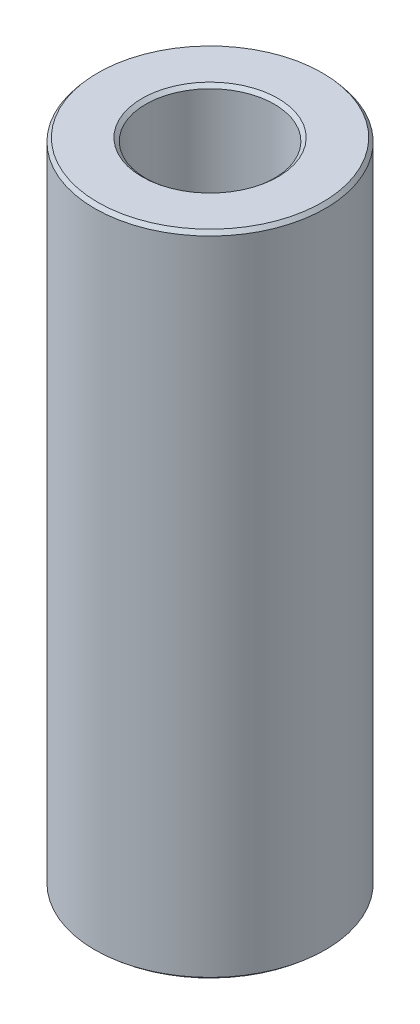
ISO-10303-21;
HEADER;
FILE_DESCRIPTION(('STEP AP214'),'2;1');
FILE_NAME('part.step','',(''),(''),'','','');
FILE_SCHEMA(('AUTOMOTIVE_DESIGN { 1 0 10303 214 1 1 1 1 }'));
ENDSEC;
DATA;
#1=APPLICATION_CONTEXT('core data for automotive mechanical design processes');
#2=APPLICATION_PROTOCOL_DEFINITION('international standard','automotive_design',2000,#1);
#3=PRODUCT_CONTEXT('',#1,'mechanical');
#4=PRODUCT('Part','Part','',(#3));
#5=PRODUCT_RELATED_PRODUCT_CATEGORY('part','',(#4));
#6=PRODUCT_DEFINITION_FORMATION('','',#4);
#7=PRODUCT_DEFINITION_CONTEXT('part definition',#1,'design');
#8=PRODUCT_DEFINITION('design','',#6,#7);
#9=PRODUCT_DEFINITION_SHAPE('','',#8);
#10=(LENGTH_UNIT() NAMED_UNIT(*) SI_UNIT(.MILLI.,.METRE.));
#11=(NAMED_UNIT(*) PLANE_ANGLE_UNIT() SI_UNIT($,.RADIAN.));
#12=(NAMED_UNIT(*) SI_UNIT($,.STERADIAN.) SOLID_ANGLE_UNIT());
#13=UNCERTAINTY_MEASURE_WITH_UNIT(LENGTH_MEASURE(1.E-05),#10,'distance_accuracy_value','');
#14=(GEOMETRIC_REPRESENTATION_CONTEXT(3) GLOBAL_UNCERTAINTY_ASSIGNED_CONTEXT((#13)) GLOBAL_UNIT_ASSIGNED_CONTEXT((#10,
#11,#12)) REPRESENTATION_CONTEXT('',''));
#15=CARTESIAN_POINT('',(0.,0.,0.));
#16=DIRECTION('',(0.,0.,1.));
#17=DIRECTION('',(1.,0.,0.));
#18=AXIS2_PLACEMENT_3D('',#15,#16,#17);
#19=CARTESIAN_POINT('',(0.,168.758989361988,0.));
#20=DIRECTION('',(0.,-1.,0.));
#21=DIRECTION('',(0.,0.,-1.));
#22=AXIS2_PLACEMENT_3D('',#19,#20,#21);
#23=CYLINDRICAL_SURFACE('',#22,30.);
#24=CARTESIAN_POINT('',(0.,0.815779864993316,0.));
#25=DIRECTION('',(0.,1.,0.));
#26=DIRECTION('',(0.,0.,1.));
#27=AXIS2_PLACEMENT_3D('',#24,#25,#26);
#28=CIRCLE('',#27,30.);
#29=CARTESIAN_POINT('',(0.,0.815779864993316,30.));
#30=VERTEX_POINT('',#29);
#31=EDGE_CURVE('E10',#30,#30,#28,.T.);
#32=ORIENTED_EDGE('',*,*,#31,.T.);
#33=EDGE_LOOP('',(#32));
#34=FACE_BOUND('',#33,.T.);
#35=CARTESIAN_POINT('',(0.,167.789038789513,0.));
#36=DIRECTION('',(0.,1.,0.));
#37=DIRECTION('',(0.,0.,1.));
#38=AXIS2_PLACEMENT_3D('',#35,#36,#37);
#39=CIRCLE('',#38,30.);
#40=CARTESIAN_POINT('',(0.,167.789038789513,30.));
#41=VERTEX_POINT('',#40);
#42=EDGE_CURVE('E50',#41,#41,#39,.F.);
#43=ORIENTED_EDGE('',*,*,#42,.T.);
#44=EDGE_LOOP('',(#43));
#45=FACE_BOUND('',#44,.T.);
#46=ADVANCED_FACE('F39',(#34,#45),#23,.T.);
#47=CARTESIAN_POINT('',(0.,168.758989361988,0.));
#48=DIRECTION('',(0.,1.,0.));
#49=DIRECTION('',(0.,0.,1.));
#50=AXIS2_PLACEMENT_3D('',#47,#48,#49);
#51=PLANE('',#50);
#52=CARTESIAN_POINT('',(0.,168.758989361988,0.));
#53=DIRECTION('',(0.,1.,0.));
#54=DIRECTION('',(0.,0.,1.));
#55=AXIS2_PLACEMENT_3D('',#52,#53,#54);
#56=CIRCLE('',#55,17.6812861898524);
#57=CARTESIAN_POINT('',(0.,168.758989361988,17.6812861898524));
#58=VERTEX_POINT('',#57);
#59=EDGE_CURVE('E58',#58,#58,#56,.F.);
#60=ORIENTED_EDGE('',*,*,#59,.T.);
#61=EDGE_LOOP('',(#60));
#62=FACE_BOUND('',#61,.T.);
#63=CARTESIAN_POINT('',(0.,168.758989361988,0.));
#64=DIRECTION('',(0.,1.,0.));
#65=DIRECTION('',(0.,0.,1.));
#66=AXIS2_PLACEMENT_3D('',#63,#64,#65);
#67=CIRCLE('',#66,29.1842201350067);
#68=CARTESIAN_POINT('',(0.,168.758989361988,29.1842201350067));
#69=VERTEX_POINT('',#68);
#70=EDGE_CURVE('E61',#69,#69,#67,.T.);
#71=ORIENTED_EDGE('',*,*,#70,.T.);
#72=EDGE_LOOP('',(#71));
#73=FACE_BOUND('',#72,.T.);
#74=ADVANCED_FACE('F88',(#62,#73),#51,.T.);
#75=CARTESIAN_POINT('',(0.,0.,0.));
#76=DIRECTION('',(0.,1.,0.));
#77=DIRECTION('',(0.,0.,1.));
#78=AXIS2_PLACEMENT_3D('',#75,#76,#77);
#79=PLANE('',#78);
#80=CARTESIAN_POINT('',(0.,0.,0.));
#81=DIRECTION('',(0.,1.,0.));
#82=DIRECTION('',(0.,0.,1.));
#83=AXIS2_PLACEMENT_3D('',#80,#81,#82);
#84=CIRCLE('',#83,17.5271154823698);
#85=CARTESIAN_POINT('',(0.,0.,17.5271154823698));
#86=VERTEX_POINT('',#85);
#87=EDGE_CURVE('E51',#86,#86,#84,.T.);
#88=ORIENTED_EDGE('',*,*,#87,.T.);
#89=EDGE_LOOP('',(#88));
#90=FACE_BOUND('',#89,.T.);
#91=CARTESIAN_POINT('',(0.,0.,0.));
#92=DIRECTION('',(0.,1.,0.));
#93=DIRECTION('',(0.,0.,1.));
#94=AXIS2_PLACEMENT_3D('',#91,#92,#93);
#95=CIRCLE('',#94,29.0300494275241);
#96=CARTESIAN_POINT('',(0.,0.,29.0300494275241));
#97=VERTEX_POINT('',#96);
#98=EDGE_CURVE('E54',#97,#97,#95,.F.);
#99=ORIENTED_EDGE('',*,*,#98,.T.);
#100=EDGE_LOOP('',(#99));
#101=FACE_BOUND('',#100,.T.);
#102=ADVANCED_FACE('F83',(#90,#101),#79,.F.);
#103=CARTESIAN_POINT('',(0.,168.758989361988,0.));
#104=DIRECTION('',(0.,-1.,0.));
#105=DIRECTION('',(0.,0.,-1.));
#106=AXIS2_PLACEMENT_3D('',#103,#104,#105);
#107=CYLINDRICAL_SURFACE('',#106,16.7113356173765);
#108=CARTESIAN_POINT('',(0.,167.943209496995,0.));
#109=DIRECTION('',(0.,1.,0.));
#110=DIRECTION('',(0.,0.,1.));
#111=AXIS2_PLACEMENT_3D('',#108,#109,#110);
#112=CIRCLE('',#111,16.7113356173765);
#113=CARTESIAN_POINT('',(0.,167.943209496995,16.7113356173765));
#114=VERTEX_POINT('',#113);
#115=EDGE_CURVE('E67',#114,#114,#112,.T.);
#116=ORIENTED_EDGE('',*,*,#115,.T.);
#117=EDGE_LOOP('',(#116));
#118=FACE_BOUND('',#117,.T.);
#119=CARTESIAN_POINT('',(0.,0.969950572475925,0.));
#120=DIRECTION('',(0.,1.,0.));
#121=DIRECTION('',(0.,0.,1.));
#122=AXIS2_PLACEMENT_3D('',#119,#120,#121);
#123=CIRCLE('',#122,16.7113356173765);
#124=CARTESIAN_POINT('',(0.,0.969950572475925,16.7113356173765));
#125=VERTEX_POINT('',#124);
#126=EDGE_CURVE('E69',#125,#125,#123,.F.);
#127=ORIENTED_EDGE('',*,*,#126,.T.);
#128=EDGE_LOOP('',(#127));
#129=FACE_BOUND('',#128,.T.);
#130=ADVANCED_FACE('F71',(#118,#129),#107,.F.);
#131=CARTESIAN_POINT('',(0.,167.943209496995,0.));
#132=DIRECTION('',(0.,1.,0.));
#133=DIRECTION('',(0.,0.,1.));
#134=AXIS2_PLACEMENT_3D('',#131,#132,#133);
#135=CONICAL_SURFACE('',#134,16.7113356173765,0.871519428310833);
#136=ORIENTED_EDGE('',*,*,#59,.F.);
#137=EDGE_LOOP('',(#136));
#138=FACE_BOUND('',#137,.T.);
#139=ORIENTED_EDGE('',*,*,#115,.F.);
#140=EDGE_LOOP('',(#139));
#141=FACE_BOUND('',#140,.T.);
#142=ADVANCED_FACE('F77',(#138,#141),#135,.F.);
#143=CARTESIAN_POINT('',(0.,0.,0.));
#144=DIRECTION('',(0.,-1.,0.));
#145=DIRECTION('',(0.,0.,-1.));
#146=AXIS2_PLACEMENT_3D('',#143,#144,#145);
#147=CONICAL_SURFACE('',#146,17.5271154823698,0.699276898484071);
#148=ORIENTED_EDGE('',*,*,#126,.F.);
#149=EDGE_LOOP('',(#148));
#150=FACE_BOUND('',#149,.T.);
#151=ORIENTED_EDGE('',*,*,#87,.F.);
#152=EDGE_LOOP('',(#151));
#153=FACE_BOUND('',#152,.T.);
#154=ADVANCED_FACE('F73',(#150,#153),#147,.F.);
#155=CARTESIAN_POINT('',(0.,0.815779864993316,0.));
#156=DIRECTION('',(0.,1.,0.));
#157=DIRECTION('',(0.,0.,1.));
#158=AXIS2_PLACEMENT_3D('',#155,#156,#157);
#159=CONICAL_SURFACE('',#158,30.,0.871519428310825);
#160=CARTESIAN_POINT('',(0.,0.,29.0300494275241));
#161=CARTESIAN_POINT('',(0.,0.00849770692701441,29.0401530793207));
#162=CARTESIAN_POINT('',(0.,0.0169954138540278,29.0502567311174));
#163=CARTESIAN_POINT('',(0.,0.0339908277080547,29.0704640347106));
#164=CARTESIAN_POINT('',(0.,0.0424885346350682,29.0805676865072));
#165=CARTESIAN_POINT('',(0.,0.0594839484890955,29.1007749901005));
#166=CARTESIAN_POINT('',(0.,0.0679816554161093,29.1108786418971));
#167=CARTESIAN_POINT('',(0.,0.0849770692701371,29.1310859454904));
#168=CARTESIAN_POINT('',(0.,0.0934747761971511,29.141189597287));
#169=CARTESIAN_POINT('',(0.,0.110470190051178,29.1613969008802));
#170=CARTESIAN_POINT('',(0.,0.118967896978191,29.1715005526768));
#171=CARTESIAN_POINT('',(0.,0.135963310832219,29.1917078562701));
#172=CARTESIAN_POINT('',(0.,0.144461017759233,29.2018115080667));
#173=CARTESIAN_POINT('',(0.,0.161456431613261,29.22201881166));
#174=CARTESIAN_POINT('',(0.,0.169954138540274,29.2321224634566));
#175=CARTESIAN_POINT('',(0.,0.186949552394301,29.2523297670498));
#176=CARTESIAN_POINT('',(0.,0.195447259321315,29.2624334188465));
#177=CARTESIAN_POINT('',(0.,0.212442673175343,29.2826407224397));
#178=CARTESIAN_POINT('',(0.,0.220940380102357,29.2927443742363));
#179=CARTESIAN_POINT('',(0.,0.237935793956384,29.3129516778296));
#180=CARTESIAN_POINT('',(0.,0.246433500883397,29.3230553296262));
#181=CARTESIAN_POINT('',(0.,0.263428914737424,29.3432626332195));
#182=CARTESIAN_POINT('',(0.,0.271926621664438,29.3533662850161));
#183=CARTESIAN_POINT('',(0.,0.288922035518466,29.3735735886093));
#184=CARTESIAN_POINT('',(0.,0.29741974244548,29.3836772404059));
#185=CARTESIAN_POINT('',(0.,0.314415156299507,29.4038845439992));
#186=CARTESIAN_POINT('',(0.,0.32291286322652,29.4139881957958));
#187=CARTESIAN_POINT('',(0.,0.339908277080548,29.4341954993891));
#188=CARTESIAN_POINT('',(0.,0.348405984007562,29.4442991511857));
#189=CARTESIAN_POINT('',(0.,0.365401397861589,29.4645064547789));
#190=CARTESIAN_POINT('',(0.,0.373899104788603,29.4746101065756));
#191=CARTESIAN_POINT('',(0.,0.39089451864263,29.4948174101688));
#192=CARTESIAN_POINT('',(0.,0.399392225569644,29.5049210619654));
#193=CARTESIAN_POINT('',(0.,0.416387639423672,29.5251283655587));
#194=CARTESIAN_POINT('',(0.,0.424885346350685,29.5352320173553));
#195=CARTESIAN_POINT('',(0.,0.441880760204713,29.5554393209486));
#196=CARTESIAN_POINT('',(0.,0.450378467131726,29.5655429727452));
#197=CARTESIAN_POINT('',(0.,0.467373880985753,29.5857502763384));
#198=CARTESIAN_POINT('',(0.,0.475871587912767,29.595853928135));
#199=CARTESIAN_POINT('',(0.,0.492867001766795,29.6160612317283));
#200=CARTESIAN_POINT('',(0.,0.501364708693809,29.6261648835249));
#201=CARTESIAN_POINT('',(0.,0.518360122547836,29.6463721871182));
#202=CARTESIAN_POINT('',(0.,0.526857829474849,29.6564758389148));
#203=CARTESIAN_POINT('',(0.,0.543853243328877,29.676683142508));
#204=CARTESIAN_POINT('',(0.,0.552350950255891,29.6867867943047));
#205=CARTESIAN_POINT('',(0.,0.569346364109919,29.7069940978979));
#206=CARTESIAN_POINT('',(0.,0.577844071036932,29.7170977496945));
#207=CARTESIAN_POINT('',(0.,0.594839484890959,29.7373050532878));
#208=CARTESIAN_POINT('',(0.,0.603337191817973,29.7474087050844));
#209=CARTESIAN_POINT('',(0.,0.620332605672001,29.7676160086777));
#210=CARTESIAN_POINT('',(0.,0.628830312599014,29.7777196604743));
#211=CARTESIAN_POINT('',(0.,0.645825726453042,29.7979269640675));
#212=CARTESIAN_POINT('',(0.,0.654323433380055,29.8080306158641));
#213=CARTESIAN_POINT('',(0.,0.671318847234082,29.8282379194574));
#214=CARTESIAN_POINT('',(0.,0.679816554161096,29.838341571254));
#215=CARTESIAN_POINT('',(0.,0.696811968015124,29.8585488748473));
#216=CARTESIAN_POINT('',(0.,0.705309674942138,29.8686525266439));
#217=CARTESIAN_POINT('',(0.,0.722305088796165,29.8888598302371));
#218=CARTESIAN_POINT('',(0.,0.730802795723178,29.8989634820338));
#219=CARTESIAN_POINT('',(0.,0.747798209577206,29.919170785627));
#220=CARTESIAN_POINT('',(0.,0.75629591650422,29.9292744374236));
#221=CARTESIAN_POINT('',(0.,0.773291330358247,29.9494817410169));
#222=CARTESIAN_POINT('',(0.,0.781789037285261,29.9595853928135));
#223=CARTESIAN_POINT('',(0.,0.798784451139288,29.9797926964068));
#224=CARTESIAN_POINT('',(0.,0.807282158066301,29.9898963482034));
#225=CARTESIAN_POINT('',(0.,0.815779864993316,30.));
#226=B_SPLINE_CURVE_WITH_KNOTS('',3,(#160,#161,#162,#163,#164,#165,#166,#167,#168,#169,#170,
#171,#172,#173,#174,#175,#176,#177,#178,#179,#180,#181,#182,#183,#184,#185,#186,#187,#188,#189,
#190,#191,#192,#193,#194,#195,#196,#197,#198,#199,#200,#201,#202,#203,#204,#205,#206,#207,#208,
#209,#210,#211,#212,#213,#214,#215,#216,#217,#218,#219,#220,#221,#222,#223,#224,#225),
.UNSPECIFIED.,.F.,.F.,(4,2,2,2,2,2,2,2,2,2,2,2,2,2,2,2,2,2,2,2,2,2,2,2,2,2,2,2,2,2,2,2,4),(0.,
0.0396062270836726,0.0792124541673479,0.118818681251021,0.158424908334693,0.198031135418368,
0.237637362502041,0.277243589585716,0.316849816669389,0.356456043753062,0.396062270836737,
0.43566849792041,0.475274725004082,0.514880952087758,0.55448717917143,0.594093406255105,
0.633699633338778,0.673305860422451,0.712912087506126,0.752518314589798,0.792124541673471,
0.831730768757146,0.871336995840819,0.910943222924494,0.950549450008167,0.990155677091839,
1.02976190417551,1.06936813125919,1.10897435834286,1.14858058542653,1.18818681251021,
1.22779303959388,1.26739926667756),.UNSPECIFIED.);
#227=EDGE_CURVE('BSEAM76',#97,#30,#226,.T.);
#228=ORIENTED_EDGE('',*,*,#98,.F.);
#229=ORIENTED_EDGE('',*,*,#31,.F.);
#230=ORIENTED_EDGE('',*,*,#227,.T.);
#231=ORIENTED_EDGE('',*,*,#227,.F.);
#232=EDGE_LOOP('',(#228,#230,#229,#231));
#233=FACE_BOUND('',#232,.T.);
#234=ADVANCED_FACE('F76',(#233),#159,.T.);
#235=CARTESIAN_POINT('',(0.,168.758989361988,0.));
#236=DIRECTION('',(0.,-1.,0.));
#237=DIRECTION('',(0.,0.,-1.));
#238=AXIS2_PLACEMENT_3D('',#235,#236,#237);
#239=CONICAL_SURFACE('',#238,29.1842201350067,0.699276898484073);
#240=ORIENTED_EDGE('',*,*,#42,.F.);
#241=EDGE_LOOP('',(#240));
#242=FACE_BOUND('',#241,.T.);
#243=ORIENTED_EDGE('',*,*,#70,.F.);
#244=EDGE_LOOP('',(#243));
#245=FACE_BOUND('',#244,.T.);
#246=ADVANCED_FACE('F45',(#242,#245),#239,.T.);
#247=CLOSED_SHELL('',(#46,#74,#102,#130,#142,#154,#234,#246));
#248=MANIFOLD_SOLID_BREP('B2',#247);
#249=ADVANCED_BREP_SHAPE_REPRESENTATION('',(#18,#248),#14);
#250=SHAPE_DEFINITION_REPRESENTATION(#9,#249);
ENDSEC;
END-ISO-10303-21;
